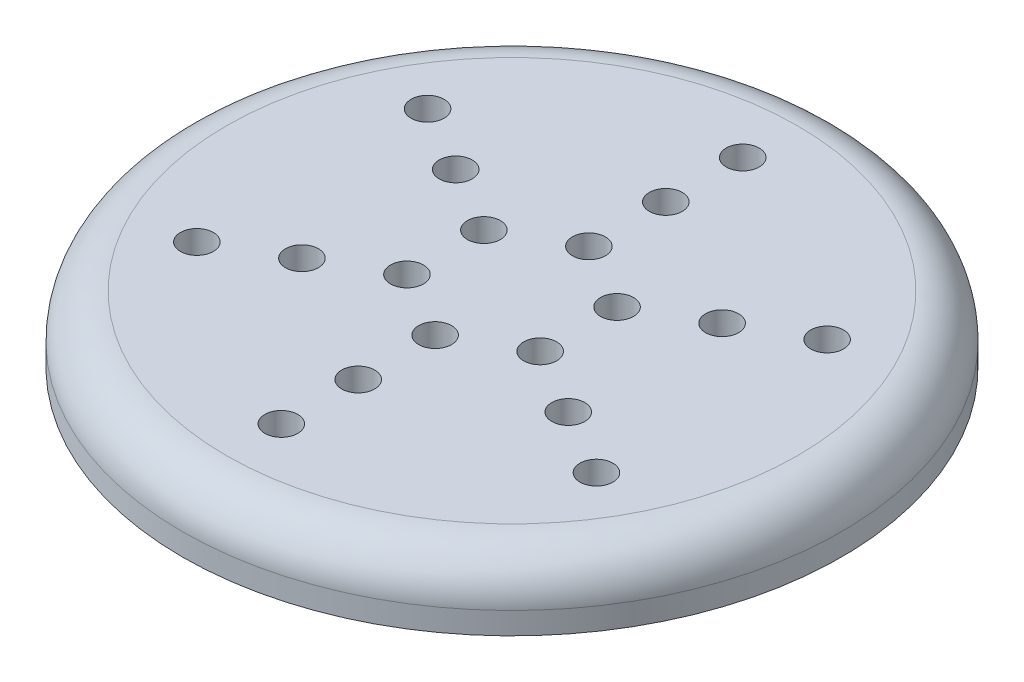
ISO-10303-21;
HEADER;
FILE_DESCRIPTION(('STEP AP214'),'2;1');
FILE_NAME('part.step','',(''),(''),'','','');
FILE_SCHEMA(('AUTOMOTIVE_DESIGN { 1 0 10303 214 1 1 1 1 }'));
ENDSEC;
DATA;
#1=APPLICATION_CONTEXT('core data for automotive mechanical design processes');
#2=APPLICATION_PROTOCOL_DEFINITION('international standard','automotive_design',2000,#1);
#3=PRODUCT_CONTEXT('',#1,'mechanical');
#4=PRODUCT('Part','Part','',(#3));
#5=PRODUCT_RELATED_PRODUCT_CATEGORY('part','',(#4));
#6=PRODUCT_DEFINITION_FORMATION('','',#4);
#7=PRODUCT_DEFINITION_CONTEXT('part definition',#1,'design');
#8=PRODUCT_DEFINITION('design','',#6,#7);
#9=PRODUCT_DEFINITION_SHAPE('','',#8);
#10=(LENGTH_UNIT() NAMED_UNIT(*) SI_UNIT(.MILLI.,.METRE.));
#11=(NAMED_UNIT(*) PLANE_ANGLE_UNIT() SI_UNIT($,.RADIAN.));
#12=(NAMED_UNIT(*) SI_UNIT($,.STERADIAN.) SOLID_ANGLE_UNIT());
#13=UNCERTAINTY_MEASURE_WITH_UNIT(LENGTH_MEASURE(1.E-05),#10,'distance_accuracy_value','');
#14=(GEOMETRIC_REPRESENTATION_CONTEXT(3) GLOBAL_UNCERTAINTY_ASSIGNED_CONTEXT((#13)) GLOBAL_UNIT_ASSIGNED_CONTEXT((#10,
#11,#12)) REPRESENTATION_CONTEXT('',''));
#15=CARTESIAN_POINT('',(0.,0.,0.));
#16=DIRECTION('',(0.,0.,1.));
#17=DIRECTION('',(1.,0.,0.));
#18=AXIS2_PLACEMENT_3D('',#15,#16,#17);
#19=CARTESIAN_POINT('',(0.,3.,0.));
#20=DIRECTION('',(0.,1.,0.));
#21=DIRECTION('',(0.,0.,1.));
#22=AXIS2_PLACEMENT_3D('',#19,#20,#21);
#23=PLANE('',#22);
#24=CARTESIAN_POINT('',(0.,3.,0.));
#25=DIRECTION('',(0.,1.,0.));
#26=DIRECTION('',(0.,0.,1.));
#27=AXIS2_PLACEMENT_3D('',#24,#25,#26);
#28=CIRCLE('',#27,13.);
#29=CARTESIAN_POINT('',(0.,3.,13.));
#30=VERTEX_POINT('',#29);
#31=EDGE_CURVE('E45',#30,#30,#28,.T.);
#32=ORIENTED_EDGE('',*,*,#31,.T.);
#33=EDGE_LOOP('',(#32));
#34=FACE_BOUND('',#33,.T.);
#35=CARTESIAN_POINT('',(-6.06217782649078,3.,-3.49999999999948));
#36=DIRECTION('',(0.,1.,0.));
#37=DIRECTION('',(0.,0.,1.));
#38=AXIS2_PLACEMENT_3D('',#35,#36,#37);
#39=CIRCLE('',#38,0.75000000000052);
#40=CARTESIAN_POINT('',(-6.06217782649078,3.,-2.74999999999896));
#41=VERTEX_POINT('',#40);
#42=EDGE_CURVE('E182',#41,#41,#39,.T.);
#43=ORIENTED_EDGE('',*,*,#42,.F.);
#44=EDGE_LOOP('',(#43));
#45=FACE_BOUND('',#44,.T.);
#46=CARTESIAN_POINT('',(-3.03108891324464,3.,1.75000000000052));
#47=DIRECTION('',(0.,1.,0.));
#48=DIRECTION('',(0.,0.,1.));
#49=AXIS2_PLACEMENT_3D('',#46,#47,#48);
#50=CIRCLE('',#49,0.75000000000104);
#51=CARTESIAN_POINT('',(-3.03108891324464,3.,2.50000000000156));
#52=VERTEX_POINT('',#51);
#53=EDGE_CURVE('E166',#52,#52,#50,.T.);
#54=ORIENTED_EDGE('',*,*,#53,.F.);
#55=EDGE_LOOP('',(#54));
#56=FACE_BOUND('',#55,.T.);
#57=CARTESIAN_POINT('',(-9.09326673973571,3.,5.25000000000052));
#58=DIRECTION('',(0.,1.,0.));
#59=DIRECTION('',(0.,0.,1.));
#60=AXIS2_PLACEMENT_3D('',#57,#58,#59);
#61=CIRCLE('',#60,0.750000000001103);
#62=CARTESIAN_POINT('',(-9.09326673973571,3.,6.00000000000162));
#63=VERTEX_POINT('',#62);
#64=EDGE_CURVE('E150',#63,#63,#61,.T.);
#65=ORIENTED_EDGE('',*,*,#64,.F.);
#66=EDGE_LOOP('',(#65));
#67=FACE_BOUND('',#66,.T.);
#68=CARTESIAN_POINT('',(1.19328316969727E-12,3.,7.));
#69=DIRECTION('',(0.,1.,0.));
#70=DIRECTION('',(0.,0.,1.));
#71=AXIS2_PLACEMENT_3D('',#68,#69,#70);
#72=CIRCLE('',#71,0.750000000001188);
#73=CARTESIAN_POINT('',(1.19328316969727E-12,3.,7.75000000000119));
#74=VERTEX_POINT('',#73);
#75=EDGE_CURVE('E134',#74,#74,#72,.T.);
#76=ORIENTED_EDGE('',*,*,#75,.F.);
#77=EDGE_LOOP('',(#76));
#78=FACE_BOUND('',#77,.T.);
#79=CARTESIAN_POINT('',(3.03108891324643,3.,1.74999999999948));
#80=DIRECTION('',(0.,1.,0.));
#81=DIRECTION('',(0.,0.,1.));
#82=AXIS2_PLACEMENT_3D('',#79,#80,#81);
#83=CIRCLE('',#82,0.75000000000072);
#84=CARTESIAN_POINT('',(3.03108891324643,3.,2.5000000000002));
#85=VERTEX_POINT('',#84);
#86=EDGE_CURVE('E118',#85,#85,#83,.T.);
#87=ORIENTED_EDGE('',*,*,#86,.F.);
#88=EDGE_LOOP('',(#87));
#89=FACE_BOUND('',#88,.T.);
#90=CARTESIAN_POINT('',(9.0932667397375,3.,5.24999999999948));
#91=DIRECTION('',(0.,1.,0.));
#92=DIRECTION('',(0.,0.,1.));
#93=AXIS2_PLACEMENT_3D('',#90,#91,#92);
#94=CIRCLE('',#93,0.750000000000755);
#95=CARTESIAN_POINT('',(9.0932667397375,3.,6.00000000000024));
#96=VERTEX_POINT('',#95);
#97=EDGE_CURVE('E102',#96,#96,#94,.T.);
#98=ORIENTED_EDGE('',*,*,#97,.F.);
#99=EDGE_LOOP('',(#98));
#100=FACE_BOUND('',#99,.T.);
#101=CARTESIAN_POINT('',(6.06217782649137,3.,-3.50000000000052));
#102=DIRECTION('',(0.,1.,0.));
#103=DIRECTION('',(0.,0.,1.));
#104=AXIS2_PLACEMENT_3D('',#101,#102,#103);
#105=CIRCLE('',#104,0.750000000000151);
#106=CARTESIAN_POINT('',(6.06217782649137,3.,-2.75000000000037));
#107=VERTEX_POINT('',#106);
#108=EDGE_CURVE('E86',#107,#107,#105,.T.);
#109=ORIENTED_EDGE('',*,*,#108,.F.);
#110=EDGE_LOOP('',(#109));
#111=FACE_BOUND('',#110,.T.);
#112=CARTESIAN_POINT('',(0.,3.,-3.5));
#113=DIRECTION('',(0.,1.,0.));
#114=DIRECTION('',(0.,0.,1.));
#115=AXIS2_PLACEMENT_3D('',#112,#113,#114);
#116=CIRCLE('',#115,0.75);
#117=CARTESIAN_POINT('',(0.,3.,-2.75));
#118=VERTEX_POINT('',#117);
#119=EDGE_CURVE('E70',#118,#118,#116,.T.);
#120=ORIENTED_EDGE('',*,*,#119,.F.);
#121=EDGE_LOOP('',(#120));
#122=FACE_BOUND('',#121,.T.);
#123=CARTESIAN_POINT('',(0.,3.,-10.5));
#124=DIRECTION('',(0.,1.,0.));
#125=DIRECTION('',(0.,0.,1.));
#126=AXIS2_PLACEMENT_3D('',#123,#124,#125);
#127=CIRCLE('',#126,0.750000000000001);
#128=CARTESIAN_POINT('',(0.,3.,-9.75));
#129=VERTEX_POINT('',#128);
#130=EDGE_CURVE('E55',#129,#129,#127,.T.);
#131=ORIENTED_EDGE('',*,*,#130,.F.);
#132=EDGE_LOOP('',(#131));
#133=FACE_BOUND('',#132,.T.);
#134=CARTESIAN_POINT('',(0.,3.,-7.));
#135=DIRECTION('',(0.,1.,0.));
#136=DIRECTION('',(0.,0.,1.));
#137=AXIS2_PLACEMENT_3D('',#134,#135,#136);
#138=CIRCLE('',#137,0.75);
#139=CARTESIAN_POINT('',(0.,3.,-6.25));
#140=VERTEX_POINT('',#139);
#141=EDGE_CURVE('E62',#140,#140,#138,.T.);
#142=ORIENTED_EDGE('',*,*,#141,.F.);
#143=EDGE_LOOP('',(#142));
#144=FACE_BOUND('',#143,.T.);
#145=CARTESIAN_POINT('',(9.0932667397369,3.,-5.25000000000052));
#146=DIRECTION('',(0.,1.,0.));
#147=DIRECTION('',(0.,0.,1.));
#148=AXIS2_PLACEMENT_3D('',#145,#146,#147);
#149=CIRCLE('',#148,0.75000000000016);
#150=CARTESIAN_POINT('',(9.0932667397369,3.,-4.50000000000036));
#151=VERTEX_POINT('',#150);
#152=EDGE_CURVE('E78',#151,#151,#149,.T.);
#153=ORIENTED_EDGE('',*,*,#152,.F.);
#154=EDGE_LOOP('',(#153));
#155=FACE_BOUND('',#154,.T.);
#156=CARTESIAN_POINT('',(3.03108891324583,3.,-1.75000000000052));
#157=DIRECTION('',(0.,1.,0.));
#158=DIRECTION('',(0.,0.,1.));
#159=AXIS2_PLACEMENT_3D('',#156,#157,#158);
#160=CIRCLE('',#159,0.750000000000143);
#161=CARTESIAN_POINT('',(3.03108891324583,3.,-1.00000000000037));
#162=VERTEX_POINT('',#161);
#163=EDGE_CURVE('E94',#162,#162,#160,.T.);
#164=ORIENTED_EDGE('',*,*,#163,.F.);
#165=EDGE_LOOP('',(#164));
#166=FACE_BOUND('',#165,.T.);
#167=CARTESIAN_POINT('',(6.06217782649197,3.,3.49999999999948));
#168=DIRECTION('',(0.,1.,0.));
#169=DIRECTION('',(0.,0.,1.));
#170=AXIS2_PLACEMENT_3D('',#167,#168,#169);
#171=CIRCLE('',#170,0.750000000000737);
#172=CARTESIAN_POINT('',(6.06217782649197,3.,4.25000000000022));
#173=VERTEX_POINT('',#172);
#174=EDGE_CURVE('E110',#173,#173,#171,.T.);
#175=ORIENTED_EDGE('',*,*,#174,.F.);
#176=EDGE_LOOP('',(#175));
#177=FACE_BOUND('',#176,.T.);
#178=CARTESIAN_POINT('',(1.19371179607697E-12,3.,10.5));
#179=DIRECTION('',(0.,1.,0.));
#180=DIRECTION('',(0.,0.,1.));
#181=AXIS2_PLACEMENT_3D('',#178,#179,#180);
#182=CIRCLE('',#181,0.750000000001212);
#183=CARTESIAN_POINT('',(1.19371179607697E-12,3.,11.2500000000012));
#184=VERTEX_POINT('',#183);
#185=EDGE_CURVE('E126',#184,#184,#182,.T.);
#186=ORIENTED_EDGE('',*,*,#185,.F.);
#187=EDGE_LOOP('',(#186));
#188=FACE_BOUND('',#187,.T.);
#189=CARTESIAN_POINT('',(1.19285454331756E-12,3.,3.5));
#190=DIRECTION('',(0.,1.,0.));
#191=DIRECTION('',(0.,0.,1.));
#192=AXIS2_PLACEMENT_3D('',#189,#190,#191);
#193=CIRCLE('',#192,0.750000000001164);
#194=CARTESIAN_POINT('',(1.19285454331756E-12,3.,4.25000000000116));
#195=VERTEX_POINT('',#194);
#196=EDGE_CURVE('E142',#195,#195,#193,.T.);
#197=ORIENTED_EDGE('',*,*,#196,.F.);
#198=EDGE_LOOP('',(#197));
#199=FACE_BOUND('',#198,.T.);
#200=CARTESIAN_POINT('',(-6.06217782649018,3.,3.50000000000052));
#201=DIRECTION('',(0.,1.,0.));
#202=DIRECTION('',(0.,0.,1.));
#203=AXIS2_PLACEMENT_3D('',#200,#201,#202);
#204=CIRCLE('',#203,0.750000000001071);
#205=CARTESIAN_POINT('',(-6.06217782649018,3.,4.25000000000159));
#206=VERTEX_POINT('',#205);
#207=EDGE_CURVE('E158',#206,#206,#204,.T.);
#208=ORIENTED_EDGE('',*,*,#207,.F.);
#209=EDGE_LOOP('',(#208));
#210=FACE_BOUND('',#209,.T.);
#211=CARTESIAN_POINT('',(-9.09326673973631,3.,-5.24999999999948));
#212=DIRECTION('',(0.,1.,0.));
#213=DIRECTION('',(0.,0.,1.));
#214=AXIS2_PLACEMENT_3D('',#211,#212,#213);
#215=CIRCLE('',#214,0.750000000000562);
#216=CARTESIAN_POINT('',(-9.09326673973631,3.,-4.49999999999891));
#217=VERTEX_POINT('',#216);
#218=EDGE_CURVE('E174',#217,#217,#215,.T.);
#219=ORIENTED_EDGE('',*,*,#218,.F.);
#220=EDGE_LOOP('',(#219));
#221=FACE_BOUND('',#220,.T.);
#222=CARTESIAN_POINT('',(-3.03108891324524,3.,-1.74999999999948));
#223=DIRECTION('',(0.,1.,0.));
#224=DIRECTION('',(0.,0.,1.));
#225=AXIS2_PLACEMENT_3D('',#222,#223,#224);
#226=CIRCLE('',#225,0.750000000000478);
#227=CARTESIAN_POINT('',(-3.03108891324524,3.,-0.999999999999004));
#228=VERTEX_POINT('',#227);
#229=EDGE_CURVE('E190',#228,#228,#226,.T.);
#230=ORIENTED_EDGE('',*,*,#229,.F.);
#231=EDGE_LOOP('',(#230));
#232=FACE_BOUND('',#231,.T.);
#233=ADVANCED_FACE('F37',(#34,#45,#56,#67,#78,#89,#100,#111,#122,#133,#144,#155,#166,#177,#188,
#199,#210,#221,#232),#23,.T.);
#234=CARTESIAN_POINT('',(0.,0.,0.));
#235=DIRECTION('',(0.,1.,0.));
#236=DIRECTION('',(0.,0.,1.));
#237=AXIS2_PLACEMENT_3D('',#234,#235,#236);
#238=PLANE('',#237);
#239=CARTESIAN_POINT('',(0.,0.,0.));
#240=DIRECTION('',(0.,1.,0.));
#241=DIRECTION('',(0.,0.,1.));
#242=AXIS2_PLACEMENT_3D('',#239,#240,#241);
#243=CIRCLE('',#242,15.);
#244=CARTESIAN_POINT('',(0.,0.,15.));
#245=VERTEX_POINT('',#244);
#246=EDGE_CURVE('E50',#245,#245,#243,.T.);
#247=ORIENTED_EDGE('',*,*,#246,.F.);
#248=EDGE_LOOP('',(#247));
#249=FACE_BOUND('',#248,.T.);
#250=CARTESIAN_POINT('',(0.,0.,-10.5));
#251=DIRECTION('',(0.,1.,0.));
#252=DIRECTION('',(0.,0.,1.));
#253=AXIS2_PLACEMENT_3D('',#250,#251,#252);
#254=CIRCLE('',#253,0.750000000000001);
#255=CARTESIAN_POINT('',(0.,0.,-9.75));
#256=VERTEX_POINT('',#255);
#257=EDGE_CURVE('E58',#256,#256,#254,.T.);
#258=ORIENTED_EDGE('',*,*,#257,.T.);
#259=EDGE_LOOP('',(#258));
#260=FACE_BOUND('',#259,.T.);
#261=CARTESIAN_POINT('',(0.,0.,-7.));
#262=DIRECTION('',(0.,1.,0.));
#263=DIRECTION('',(0.,0.,1.));
#264=AXIS2_PLACEMENT_3D('',#261,#262,#263);
#265=CIRCLE('',#264,0.75);
#266=CARTESIAN_POINT('',(0.,0.,-6.25));
#267=VERTEX_POINT('',#266);
#268=EDGE_CURVE('E66',#267,#267,#265,.T.);
#269=ORIENTED_EDGE('',*,*,#268,.T.);
#270=EDGE_LOOP('',(#269));
#271=FACE_BOUND('',#270,.T.);
#272=CARTESIAN_POINT('',(0.,0.,-3.5));
#273=DIRECTION('',(0.,1.,0.));
#274=DIRECTION('',(0.,0.,1.));
#275=AXIS2_PLACEMENT_3D('',#272,#273,#274);
#276=CIRCLE('',#275,0.75);
#277=CARTESIAN_POINT('',(0.,0.,-2.75));
#278=VERTEX_POINT('',#277);
#279=EDGE_CURVE('E74',#278,#278,#276,.T.);
#280=ORIENTED_EDGE('',*,*,#279,.T.);
#281=EDGE_LOOP('',(#280));
#282=FACE_BOUND('',#281,.T.);
#283=CARTESIAN_POINT('',(9.0932667397369,0.,-5.25000000000052));
#284=DIRECTION('',(0.,1.,0.));
#285=DIRECTION('',(0.,0.,1.));
#286=AXIS2_PLACEMENT_3D('',#283,#284,#285);
#287=CIRCLE('',#286,0.75000000000016);
#288=CARTESIAN_POINT('',(9.0932667397369,0.,-4.50000000000036));
#289=VERTEX_POINT('',#288);
#290=EDGE_CURVE('E82',#289,#289,#287,.T.);
#291=ORIENTED_EDGE('',*,*,#290,.T.);
#292=EDGE_LOOP('',(#291));
#293=FACE_BOUND('',#292,.T.);
#294=CARTESIAN_POINT('',(6.06217782649137,0.,-3.50000000000052));
#295=DIRECTION('',(0.,1.,0.));
#296=DIRECTION('',(0.,0.,1.));
#297=AXIS2_PLACEMENT_3D('',#294,#295,#296);
#298=CIRCLE('',#297,0.750000000000151);
#299=CARTESIAN_POINT('',(6.06217782649137,0.,-2.75000000000037));
#300=VERTEX_POINT('',#299);
#301=EDGE_CURVE('E90',#300,#300,#298,.T.);
#302=ORIENTED_EDGE('',*,*,#301,.T.);
#303=EDGE_LOOP('',(#302));
#304=FACE_BOUND('',#303,.T.);
#305=CARTESIAN_POINT('',(3.03108891324583,0.,-1.75000000000052));
#306=DIRECTION('',(0.,1.,0.));
#307=DIRECTION('',(0.,0.,1.));
#308=AXIS2_PLACEMENT_3D('',#305,#306,#307);
#309=CIRCLE('',#308,0.750000000000143);
#310=CARTESIAN_POINT('',(3.03108891324583,0.,-1.00000000000037));
#311=VERTEX_POINT('',#310);
#312=EDGE_CURVE('E98',#311,#311,#309,.T.);
#313=ORIENTED_EDGE('',*,*,#312,.T.);
#314=EDGE_LOOP('',(#313));
#315=FACE_BOUND('',#314,.T.);
#316=CARTESIAN_POINT('',(9.0932667397375,0.,5.24999999999948));
#317=DIRECTION('',(0.,1.,0.));
#318=DIRECTION('',(0.,0.,1.));
#319=AXIS2_PLACEMENT_3D('',#316,#317,#318);
#320=CIRCLE('',#319,0.750000000000755);
#321=CARTESIAN_POINT('',(9.0932667397375,0.,6.00000000000024));
#322=VERTEX_POINT('',#321);
#323=EDGE_CURVE('E106',#322,#322,#320,.T.);
#324=ORIENTED_EDGE('',*,*,#323,.T.);
#325=EDGE_LOOP('',(#324));
#326=FACE_BOUND('',#325,.T.);
#327=CARTESIAN_POINT('',(6.06217782649197,0.,3.49999999999948));
#328=DIRECTION('',(0.,1.,0.));
#329=DIRECTION('',(0.,0.,1.));
#330=AXIS2_PLACEMENT_3D('',#327,#328,#329);
#331=CIRCLE('',#330,0.750000000000737);
#332=CARTESIAN_POINT('',(6.06217782649197,0.,4.25000000000022));
#333=VERTEX_POINT('',#332);
#334=EDGE_CURVE('E114',#333,#333,#331,.T.);
#335=ORIENTED_EDGE('',*,*,#334,.T.);
#336=EDGE_LOOP('',(#335));
#337=FACE_BOUND('',#336,.T.);
#338=CARTESIAN_POINT('',(3.03108891324643,0.,1.74999999999948));
#339=DIRECTION('',(0.,1.,0.));
#340=DIRECTION('',(0.,0.,1.));
#341=AXIS2_PLACEMENT_3D('',#338,#339,#340);
#342=CIRCLE('',#341,0.75000000000072);
#343=CARTESIAN_POINT('',(3.03108891324643,0.,2.5000000000002));
#344=VERTEX_POINT('',#343);
#345=EDGE_CURVE('E122',#344,#344,#342,.T.);
#346=ORIENTED_EDGE('',*,*,#345,.T.);
#347=EDGE_LOOP('',(#346));
#348=FACE_BOUND('',#347,.T.);
#349=CARTESIAN_POINT('',(1.19371179607697E-12,0.,10.5));
#350=DIRECTION('',(0.,1.,0.));
#351=DIRECTION('',(0.,0.,1.));
#352=AXIS2_PLACEMENT_3D('',#349,#350,#351);
#353=CIRCLE('',#352,0.750000000001212);
#354=CARTESIAN_POINT('',(1.19371179607697E-12,0.,11.2500000000012));
#355=VERTEX_POINT('',#354);
#356=EDGE_CURVE('E130',#355,#355,#353,.T.);
#357=ORIENTED_EDGE('',*,*,#356,.T.);
#358=EDGE_LOOP('',(#357));
#359=FACE_BOUND('',#358,.T.);
#360=CARTESIAN_POINT('',(1.19328316969727E-12,0.,7.));
#361=DIRECTION('',(0.,1.,0.));
#362=DIRECTION('',(0.,0.,1.));
#363=AXIS2_PLACEMENT_3D('',#360,#361,#362);
#364=CIRCLE('',#363,0.750000000001188);
#365=CARTESIAN_POINT('',(1.19328316969727E-12,0.,7.75000000000119));
#366=VERTEX_POINT('',#365);
#367=EDGE_CURVE('E138',#366,#366,#364,.T.);
#368=ORIENTED_EDGE('',*,*,#367,.T.);
#369=EDGE_LOOP('',(#368));
#370=FACE_BOUND('',#369,.T.);
#371=CARTESIAN_POINT('',(1.19285454331756E-12,0.,3.5));
#372=DIRECTION('',(0.,1.,0.));
#373=DIRECTION('',(0.,0.,1.));
#374=AXIS2_PLACEMENT_3D('',#371,#372,#373);
#375=CIRCLE('',#374,0.750000000001164);
#376=CARTESIAN_POINT('',(1.19285454331756E-12,0.,4.25000000000116));
#377=VERTEX_POINT('',#376);
#378=EDGE_CURVE('E146',#377,#377,#375,.T.);
#379=ORIENTED_EDGE('',*,*,#378,.T.);
#380=EDGE_LOOP('',(#379));
#381=FACE_BOUND('',#380,.T.);
#382=CARTESIAN_POINT('',(-9.09326673973571,0.,5.25000000000052));
#383=DIRECTION('',(0.,1.,0.));
#384=DIRECTION('',(0.,0.,1.));
#385=AXIS2_PLACEMENT_3D('',#382,#383,#384);
#386=CIRCLE('',#385,0.750000000001103);
#387=CARTESIAN_POINT('',(-9.09326673973571,0.,6.00000000000162));
#388=VERTEX_POINT('',#387);
#389=EDGE_CURVE('E154',#388,#388,#386,.T.);
#390=ORIENTED_EDGE('',*,*,#389,.T.);
#391=EDGE_LOOP('',(#390));
#392=FACE_BOUND('',#391,.T.);
#393=CARTESIAN_POINT('',(-6.06217782649018,0.,3.50000000000052));
#394=DIRECTION('',(0.,1.,0.));
#395=DIRECTION('',(0.,0.,1.));
#396=AXIS2_PLACEMENT_3D('',#393,#394,#395);
#397=CIRCLE('',#396,0.750000000001071);
#398=CARTESIAN_POINT('',(-6.06217782649018,0.,4.25000000000159));
#399=VERTEX_POINT('',#398);
#400=EDGE_CURVE('E162',#399,#399,#397,.T.);
#401=ORIENTED_EDGE('',*,*,#400,.T.);
#402=EDGE_LOOP('',(#401));
#403=FACE_BOUND('',#402,.T.);
#404=CARTESIAN_POINT('',(-3.03108891324464,0.,1.75000000000052));
#405=DIRECTION('',(0.,1.,0.));
#406=DIRECTION('',(0.,0.,1.));
#407=AXIS2_PLACEMENT_3D('',#404,#405,#406);
#408=CIRCLE('',#407,0.75000000000104);
#409=CARTESIAN_POINT('',(-3.03108891324464,0.,2.50000000000156));
#410=VERTEX_POINT('',#409);
#411=EDGE_CURVE('E170',#410,#410,#408,.T.);
#412=ORIENTED_EDGE('',*,*,#411,.T.);
#413=EDGE_LOOP('',(#412));
#414=FACE_BOUND('',#413,.T.);
#415=CARTESIAN_POINT('',(-9.09326673973631,0.,-5.24999999999948));
#416=DIRECTION('',(0.,1.,0.));
#417=DIRECTION('',(0.,0.,1.));
#418=AXIS2_PLACEMENT_3D('',#415,#416,#417);
#419=CIRCLE('',#418,0.750000000000562);
#420=CARTESIAN_POINT('',(-9.09326673973631,0.,-4.49999999999891));
#421=VERTEX_POINT('',#420);
#422=EDGE_CURVE('E178',#421,#421,#419,.T.);
#423=ORIENTED_EDGE('',*,*,#422,.T.);
#424=EDGE_LOOP('',(#423));
#425=FACE_BOUND('',#424,.T.);
#426=CARTESIAN_POINT('',(-6.06217782649078,0.,-3.49999999999948));
#427=DIRECTION('',(0.,1.,0.));
#428=DIRECTION('',(0.,0.,1.));
#429=AXIS2_PLACEMENT_3D('',#426,#427,#428);
#430=CIRCLE('',#429,0.75000000000052);
#431=CARTESIAN_POINT('',(-6.06217782649078,0.,-2.74999999999896));
#432=VERTEX_POINT('',#431);
#433=EDGE_CURVE('E186',#432,#432,#430,.T.);
#434=ORIENTED_EDGE('',*,*,#433,.T.);
#435=EDGE_LOOP('',(#434));
#436=FACE_BOUND('',#435,.T.);
#437=CARTESIAN_POINT('',(-3.03108891324524,0.,-1.74999999999948));
#438=DIRECTION('',(0.,1.,0.));
#439=DIRECTION('',(0.,0.,1.));
#440=AXIS2_PLACEMENT_3D('',#437,#438,#439);
#441=CIRCLE('',#440,0.750000000000478);
#442=CARTESIAN_POINT('',(-3.03108891324524,0.,-0.999999999999004));
#443=VERTEX_POINT('',#442);
#444=EDGE_CURVE('E194',#443,#443,#441,.T.);
#445=ORIENTED_EDGE('',*,*,#444,.T.);
#446=EDGE_LOOP('',(#445));
#447=FACE_BOUND('',#446,.T.);
#448=ADVANCED_FACE('F206',(#249,#260,#271,#282,#293,#304,#315,#326,#337,#348,#359,#370,#381,
#392,#403,#414,#425,#436,#447),#238,.F.);
#449=CARTESIAN_POINT('',(0.,3.,0.));
#450=DIRECTION('',(0.,-1.,0.));
#451=DIRECTION('',(0.,0.,-1.));
#452=AXIS2_PLACEMENT_3D('',#449,#450,#451);
#453=CYLINDRICAL_SURFACE('',#452,15.);
#454=CARTESIAN_POINT('',(0.,1.,0.));
#455=DIRECTION('',(0.,1.,0.));
#456=DIRECTION('',(0.,0.,1.));
#457=AXIS2_PLACEMENT_3D('',#454,#455,#456);
#458=CIRCLE('',#457,15.);
#459=CARTESIAN_POINT('',(0.,1.,15.));
#460=VERTEX_POINT('',#459);
#461=EDGE_CURVE('E10',#460,#460,#458,.F.);
#462=ORIENTED_EDGE('',*,*,#461,.T.);
#463=EDGE_LOOP('',(#462));
#464=FACE_BOUND('',#463,.T.);
#465=ORIENTED_EDGE('',*,*,#246,.T.);
#466=EDGE_LOOP('',(#465));
#467=FACE_BOUND('',#466,.T.);
#468=ADVANCED_FACE('F211',(#464,#467),#453,.T.);
#469=CARTESIAN_POINT('',(0.,3.,-10.5));
#470=DIRECTION('',(0.,-1.,0.));
#471=DIRECTION('',(0.,0.,-1.));
#472=AXIS2_PLACEMENT_3D('',#469,#470,#471);
#473=CYLINDRICAL_SURFACE('',#472,0.750000000000001);
#474=ORIENTED_EDGE('',*,*,#130,.T.);
#475=EDGE_LOOP('',(#474));
#476=FACE_BOUND('',#475,.T.);
#477=ORIENTED_EDGE('',*,*,#257,.F.);
#478=EDGE_LOOP('',(#477));
#479=FACE_BOUND('',#478,.T.);
#480=ADVANCED_FACE('F216',(#476,#479),#473,.F.);
#481=CARTESIAN_POINT('',(0.,3.,-7.));
#482=DIRECTION('',(0.,-1.,0.));
#483=DIRECTION('',(0.,0.,-1.));
#484=AXIS2_PLACEMENT_3D('',#481,#482,#483);
#485=CYLINDRICAL_SURFACE('',#484,0.75);
#486=ORIENTED_EDGE('',*,*,#141,.T.);
#487=EDGE_LOOP('',(#486));
#488=FACE_BOUND('',#487,.T.);
#489=ORIENTED_EDGE('',*,*,#268,.F.);
#490=EDGE_LOOP('',(#489));
#491=FACE_BOUND('',#490,.T.);
#492=ADVANCED_FACE('F222',(#488,#491),#485,.F.);
#493=CARTESIAN_POINT('',(0.,3.,-3.5));
#494=DIRECTION('',(0.,-1.,0.));
#495=DIRECTION('',(0.,0.,-1.));
#496=AXIS2_PLACEMENT_3D('',#493,#494,#495);
#497=CYLINDRICAL_SURFACE('',#496,0.75);
#498=ORIENTED_EDGE('',*,*,#119,.T.);
#499=EDGE_LOOP('',(#498));
#500=FACE_BOUND('',#499,.T.);
#501=ORIENTED_EDGE('',*,*,#279,.F.);
#502=EDGE_LOOP('',(#501));
#503=FACE_BOUND('',#502,.T.);
#504=ADVANCED_FACE('F324',(#500,#503),#497,.F.);
#505=CARTESIAN_POINT('',(9.0932667397369,3.,-5.25000000000052));
#506=DIRECTION('',(0.,-1.,0.));
#507=DIRECTION('',(0.,0.,-1.));
#508=AXIS2_PLACEMENT_3D('',#505,#506,#507);
#509=CYLINDRICAL_SURFACE('',#508,0.75000000000016);
#510=ORIENTED_EDGE('',*,*,#152,.T.);
#511=EDGE_LOOP('',(#510));
#512=FACE_BOUND('',#511,.T.);
#513=ORIENTED_EDGE('',*,*,#290,.F.);
#514=EDGE_LOOP('',(#513));
#515=FACE_BOUND('',#514,.T.);
#516=ADVANCED_FACE('F320',(#512,#515),#509,.F.);
#517=CARTESIAN_POINT('',(6.06217782649137,3.,-3.50000000000052));
#518=DIRECTION('',(0.,-1.,0.));
#519=DIRECTION('',(0.,0.,-1.));
#520=AXIS2_PLACEMENT_3D('',#517,#518,#519);
#521=CYLINDRICAL_SURFACE('',#520,0.750000000000151);
#522=ORIENTED_EDGE('',*,*,#108,.T.);
#523=EDGE_LOOP('',(#522));
#524=FACE_BOUND('',#523,.T.);
#525=ORIENTED_EDGE('',*,*,#301,.F.);
#526=EDGE_LOOP('',(#525));
#527=FACE_BOUND('',#526,.T.);
#528=ADVANCED_FACE('F316',(#524,#527),#521,.F.);
#529=CARTESIAN_POINT('',(3.03108891324583,3.,-1.75000000000052));
#530=DIRECTION('',(0.,-1.,0.));
#531=DIRECTION('',(0.,0.,-1.));
#532=AXIS2_PLACEMENT_3D('',#529,#530,#531);
#533=CYLINDRICAL_SURFACE('',#532,0.750000000000143);
#534=ORIENTED_EDGE('',*,*,#163,.T.);
#535=EDGE_LOOP('',(#534));
#536=FACE_BOUND('',#535,.T.);
#537=ORIENTED_EDGE('',*,*,#312,.F.);
#538=EDGE_LOOP('',(#537));
#539=FACE_BOUND('',#538,.T.);
#540=ADVANCED_FACE('F312',(#536,#539),#533,.F.);
#541=CARTESIAN_POINT('',(9.0932667397375,3.,5.24999999999948));
#542=DIRECTION('',(0.,-1.,0.));
#543=DIRECTION('',(0.,0.,-1.));
#544=AXIS2_PLACEMENT_3D('',#541,#542,#543);
#545=CYLINDRICAL_SURFACE('',#544,0.750000000000755);
#546=ORIENTED_EDGE('',*,*,#97,.T.);
#547=EDGE_LOOP('',(#546));
#548=FACE_BOUND('',#547,.T.);
#549=ORIENTED_EDGE('',*,*,#323,.F.);
#550=EDGE_LOOP('',(#549));
#551=FACE_BOUND('',#550,.T.);
#552=ADVANCED_FACE('F308',(#548,#551),#545,.F.);
#553=CARTESIAN_POINT('',(6.06217782649197,3.,3.49999999999948));
#554=DIRECTION('',(0.,-1.,0.));
#555=DIRECTION('',(0.,0.,-1.));
#556=AXIS2_PLACEMENT_3D('',#553,#554,#555);
#557=CYLINDRICAL_SURFACE('',#556,0.750000000000737);
#558=ORIENTED_EDGE('',*,*,#174,.T.);
#559=EDGE_LOOP('',(#558));
#560=FACE_BOUND('',#559,.T.);
#561=ORIENTED_EDGE('',*,*,#334,.F.);
#562=EDGE_LOOP('',(#561));
#563=FACE_BOUND('',#562,.T.);
#564=ADVANCED_FACE('F304',(#560,#563),#557,.F.);
#565=CARTESIAN_POINT('',(3.03108891324643,3.,1.74999999999948));
#566=DIRECTION('',(0.,-1.,0.));
#567=DIRECTION('',(0.,0.,-1.));
#568=AXIS2_PLACEMENT_3D('',#565,#566,#567);
#569=CYLINDRICAL_SURFACE('',#568,0.75000000000072);
#570=ORIENTED_EDGE('',*,*,#86,.T.);
#571=EDGE_LOOP('',(#570));
#572=FACE_BOUND('',#571,.T.);
#573=ORIENTED_EDGE('',*,*,#345,.F.);
#574=EDGE_LOOP('',(#573));
#575=FACE_BOUND('',#574,.T.);
#576=ADVANCED_FACE('F300',(#572,#575),#569,.F.);
#577=CARTESIAN_POINT('',(1.19371179607697E-12,3.,10.5));
#578=DIRECTION('',(0.,-1.,0.));
#579=DIRECTION('',(0.,0.,-1.));
#580=AXIS2_PLACEMENT_3D('',#577,#578,#579);
#581=CYLINDRICAL_SURFACE('',#580,0.750000000001212);
#582=ORIENTED_EDGE('',*,*,#185,.T.);
#583=EDGE_LOOP('',(#582));
#584=FACE_BOUND('',#583,.T.);
#585=ORIENTED_EDGE('',*,*,#356,.F.);
#586=EDGE_LOOP('',(#585));
#587=FACE_BOUND('',#586,.T.);
#588=ADVANCED_FACE('F296',(#584,#587),#581,.F.);
#589=CARTESIAN_POINT('',(1.19328316969727E-12,3.,7.));
#590=DIRECTION('',(0.,-1.,0.));
#591=DIRECTION('',(0.,0.,-1.));
#592=AXIS2_PLACEMENT_3D('',#589,#590,#591);
#593=CYLINDRICAL_SURFACE('',#592,0.750000000001188);
#594=ORIENTED_EDGE('',*,*,#75,.T.);
#595=EDGE_LOOP('',(#594));
#596=FACE_BOUND('',#595,.T.);
#597=ORIENTED_EDGE('',*,*,#367,.F.);
#598=EDGE_LOOP('',(#597));
#599=FACE_BOUND('',#598,.T.);
#600=ADVANCED_FACE('F292',(#596,#599),#593,.F.);
#601=CARTESIAN_POINT('',(1.19285454331756E-12,3.,3.5));
#602=DIRECTION('',(0.,-1.,0.));
#603=DIRECTION('',(0.,0.,-1.));
#604=AXIS2_PLACEMENT_3D('',#601,#602,#603);
#605=CYLINDRICAL_SURFACE('',#604,0.750000000001164);
#606=ORIENTED_EDGE('',*,*,#196,.T.);
#607=EDGE_LOOP('',(#606));
#608=FACE_BOUND('',#607,.T.);
#609=ORIENTED_EDGE('',*,*,#378,.F.);
#610=EDGE_LOOP('',(#609));
#611=FACE_BOUND('',#610,.T.);
#612=ADVANCED_FACE('F288',(#608,#611),#605,.F.);
#613=CARTESIAN_POINT('',(-9.09326673973571,3.,5.25000000000052));
#614=DIRECTION('',(0.,-1.,0.));
#615=DIRECTION('',(0.,0.,-1.));
#616=AXIS2_PLACEMENT_3D('',#613,#614,#615);
#617=CYLINDRICAL_SURFACE('',#616,0.750000000001103);
#618=ORIENTED_EDGE('',*,*,#64,.T.);
#619=EDGE_LOOP('',(#618));
#620=FACE_BOUND('',#619,.T.);
#621=ORIENTED_EDGE('',*,*,#389,.F.);
#622=EDGE_LOOP('',(#621));
#623=FACE_BOUND('',#622,.T.);
#624=ADVANCED_FACE('F284',(#620,#623),#617,.F.);
#625=CARTESIAN_POINT('',(-6.06217782649018,3.,3.50000000000052));
#626=DIRECTION('',(0.,-1.,0.));
#627=DIRECTION('',(0.,0.,-1.));
#628=AXIS2_PLACEMENT_3D('',#625,#626,#627);
#629=CYLINDRICAL_SURFACE('',#628,0.750000000001071);
#630=ORIENTED_EDGE('',*,*,#207,.T.);
#631=EDGE_LOOP('',(#630));
#632=FACE_BOUND('',#631,.T.);
#633=ORIENTED_EDGE('',*,*,#400,.F.);
#634=EDGE_LOOP('',(#633));
#635=FACE_BOUND('',#634,.T.);
#636=ADVANCED_FACE('F280',(#632,#635),#629,.F.);
#637=CARTESIAN_POINT('',(-3.03108891324464,3.,1.75000000000052));
#638=DIRECTION('',(0.,-1.,0.));
#639=DIRECTION('',(0.,0.,-1.));
#640=AXIS2_PLACEMENT_3D('',#637,#638,#639);
#641=CYLINDRICAL_SURFACE('',#640,0.75000000000104);
#642=ORIENTED_EDGE('',*,*,#53,.T.);
#643=EDGE_LOOP('',(#642));
#644=FACE_BOUND('',#643,.T.);
#645=ORIENTED_EDGE('',*,*,#411,.F.);
#646=EDGE_LOOP('',(#645));
#647=FACE_BOUND('',#646,.T.);
#648=ADVANCED_FACE('F276',(#644,#647),#641,.F.);
#649=CARTESIAN_POINT('',(-9.09326673973631,3.,-5.24999999999948));
#650=DIRECTION('',(0.,-1.,0.));
#651=DIRECTION('',(0.,0.,-1.));
#652=AXIS2_PLACEMENT_3D('',#649,#650,#651);
#653=CYLINDRICAL_SURFACE('',#652,0.750000000000562);
#654=ORIENTED_EDGE('',*,*,#218,.T.);
#655=EDGE_LOOP('',(#654));
#656=FACE_BOUND('',#655,.T.);
#657=ORIENTED_EDGE('',*,*,#422,.F.);
#658=EDGE_LOOP('',(#657));
#659=FACE_BOUND('',#658,.T.);
#660=ADVANCED_FACE('F270',(#656,#659),#653,.F.);
#661=CARTESIAN_POINT('',(-6.06217782649078,3.,-3.49999999999948));
#662=DIRECTION('',(0.,-1.,0.));
#663=DIRECTION('',(0.,0.,-1.));
#664=AXIS2_PLACEMENT_3D('',#661,#662,#663);
#665=CYLINDRICAL_SURFACE('',#664,0.75000000000052);
#666=ORIENTED_EDGE('',*,*,#42,.T.);
#667=EDGE_LOOP('',(#666));
#668=FACE_BOUND('',#667,.T.);
#669=ORIENTED_EDGE('',*,*,#433,.F.);
#670=EDGE_LOOP('',(#669));
#671=FACE_BOUND('',#670,.T.);
#672=ADVANCED_FACE('F263',(#668,#671),#665,.F.);
#673=CARTESIAN_POINT('',(-3.03108891324524,3.,-1.74999999999948));
#674=DIRECTION('',(0.,-1.,0.));
#675=DIRECTION('',(0.,0.,-1.));
#676=AXIS2_PLACEMENT_3D('',#673,#674,#675);
#677=CYLINDRICAL_SURFACE('',#676,0.750000000000478);
#678=ORIENTED_EDGE('',*,*,#229,.T.);
#679=EDGE_LOOP('',(#678));
#680=FACE_BOUND('',#679,.T.);
#681=ORIENTED_EDGE('',*,*,#444,.F.);
#682=EDGE_LOOP('',(#681));
#683=FACE_BOUND('',#682,.T.);
#684=ADVANCED_FACE('F202',(#680,#683),#677,.F.);
#685=CARTESIAN_POINT('',(0.,1.,0.));
#686=DIRECTION('',(0.,1.,0.));
#687=DIRECTION('',(0.,0.,1.));
#688=AXIS2_PLACEMENT_3D('',#685,#686,#687);
#689=TOROIDAL_SURFACE('',#688,13.,2.);
#690=ORIENTED_EDGE('',*,*,#461,.F.);
#691=EDGE_LOOP('',(#690));
#692=FACE_BOUND('',#691,.T.);
#693=ORIENTED_EDGE('',*,*,#31,.F.);
#694=EDGE_LOOP('',(#693));
#695=FACE_BOUND('',#694,.T.);
#696=ADVANCED_FACE('F39',(#692,#695),#689,.T.);
#697=CLOSED_SHELL('',(#233,#448,#468,#480,#492,#504,#516,#528,#540,#552,#564,#576,#588,#600,
#612,#624,#636,#648,#660,#672,#684,#696));
#698=MANIFOLD_SOLID_BREP('B2',#697);
#699=ADVANCED_BREP_SHAPE_REPRESENTATION('',(#18,#698),#14);
#700=SHAPE_DEFINITION_REPRESENTATION(#9,#699);
ENDSEC;
END-ISO-10303-21;
